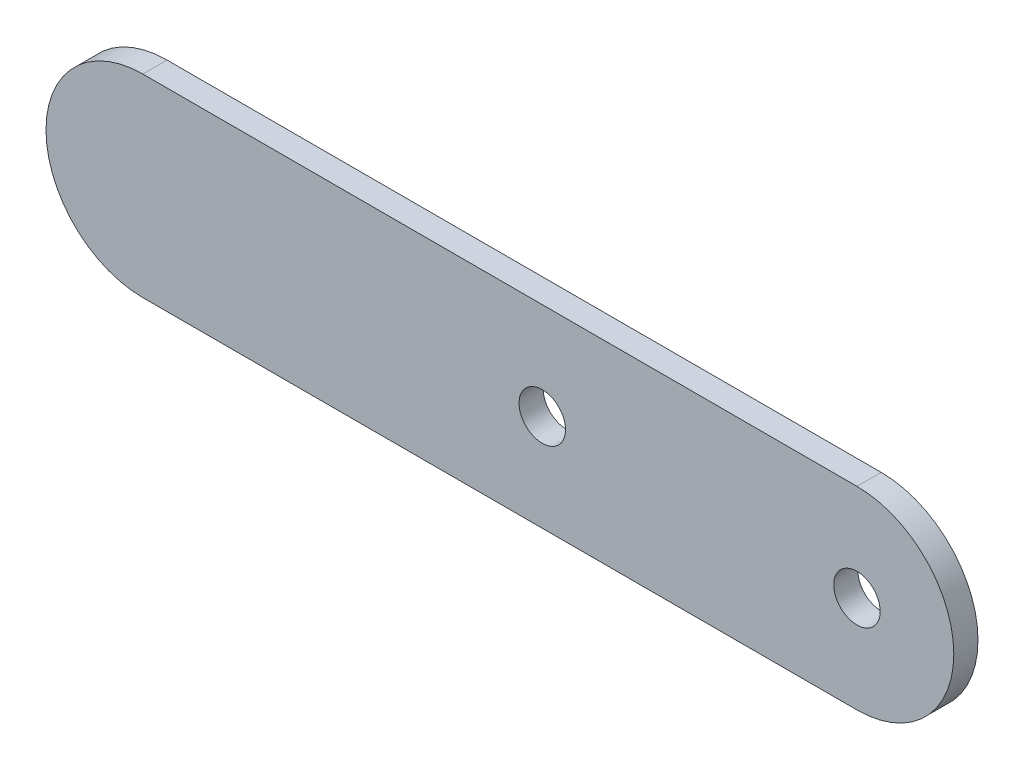
ISO-10303-21;
HEADER;
FILE_DESCRIPTION(('STEP AP214'),'2;1');
FILE_NAME('part.step','',(''),(''),'','','');
FILE_SCHEMA(('AUTOMOTIVE_DESIGN { 1 0 10303 214 1 1 1 1 }'));
ENDSEC;
DATA;
#1=APPLICATION_CONTEXT('core data for automotive mechanical design processes');
#2=APPLICATION_PROTOCOL_DEFINITION('international standard','automotive_design',2000,#1);
#3=PRODUCT_CONTEXT('',#1,'mechanical');
#4=PRODUCT('Part','Part','',(#3));
#5=PRODUCT_RELATED_PRODUCT_CATEGORY('part','',(#4));
#6=PRODUCT_DEFINITION_FORMATION('','',#4);
#7=PRODUCT_DEFINITION_CONTEXT('part definition',#1,'design');
#8=PRODUCT_DEFINITION('design','',#6,#7);
#9=PRODUCT_DEFINITION_SHAPE('','',#8);
#10=(LENGTH_UNIT() NAMED_UNIT(*) SI_UNIT(.MILLI.,.METRE.));
#11=(NAMED_UNIT(*) PLANE_ANGLE_UNIT() SI_UNIT($,.RADIAN.));
#12=(NAMED_UNIT(*) SI_UNIT($,.STERADIAN.) SOLID_ANGLE_UNIT());
#13=UNCERTAINTY_MEASURE_WITH_UNIT(LENGTH_MEASURE(1.E-05),#10,'distance_accuracy_value','');
#14=(GEOMETRIC_REPRESENTATION_CONTEXT(3) GLOBAL_UNCERTAINTY_ASSIGNED_CONTEXT((#13)) GLOBAL_UNIT_ASSIGNED_CONTEXT((#10,
#11,#12)) REPRESENTATION_CONTEXT('',''));
#15=CARTESIAN_POINT('',(0.,0.,0.));
#16=DIRECTION('',(0.,0.,1.));
#17=DIRECTION('',(1.,0.,0.));
#18=AXIS2_PLACEMENT_3D('',#15,#16,#17);
#19=CARTESIAN_POINT('',(46.83125,0.,3.175));
#20=DIRECTION('',(0.,0.,1.));
#21=DIRECTION('',(1.,0.,0.));
#22=AXIS2_PLACEMENT_3D('',#19,#20,#21);
#23=PLANE('',#22);
#24=CARTESIAN_POINT('',(46.83125,0.,3.175));
#25=DIRECTION('',(0.,0.,1.));
#26=DIRECTION('',(1.,0.,0.));
#27=AXIS2_PLACEMENT_3D('',#24,#25,#26);
#28=CIRCLE('',#27,3.048);
#29=CARTESIAN_POINT('',(49.87925,0.,3.175));
#30=VERTEX_POINT('',#29);
#31=EDGE_CURVE('E112',#30,#30,#28,.T.);
#32=ORIENTED_EDGE('',*,*,#31,.F.);
#33=EDGE_LOOP('',(#32));
#34=FACE_BOUND('',#33,.T.);
#35=CARTESIAN_POINT('',(46.83125,0.,3.175));
#36=DIRECTION('',(0.,0.,1.));
#37=DIRECTION('',(1.,0.,0.));
#38=AXIS2_PLACEMENT_3D('',#35,#36,#37);
#39=CIRCLE('',#38,12.7);
#40=CARTESIAN_POINT('',(46.83125,-12.7,3.175));
#41=VERTEX_POINT('',#40);
#42=CARTESIAN_POINT('',(46.83125,12.7,3.175));
#43=VERTEX_POINT('',#42);
#44=EDGE_CURVE('E92',#41,#43,#39,.T.);
#45=ORIENTED_EDGE('',*,*,#44,.T.);
#46=DIRECTION('',(-1.,0.,0.));
#47=VECTOR('',#46,1.);
#48=CARTESIAN_POINT('',(-46.83125,12.7,3.175));
#49=LINE('',#48,#47);
#50=CARTESIAN_POINT('',(-46.83125,12.7,3.175));
#51=VERTEX_POINT('',#50);
#52=EDGE_CURVE('E87',#43,#51,#49,.T.);
#53=ORIENTED_EDGE('',*,*,#52,.T.);
#54=CARTESIAN_POINT('',(-46.83125,0.,3.175));
#55=DIRECTION('',(0.,0.,1.));
#56=DIRECTION('',(1.,0.,0.));
#57=AXIS2_PLACEMENT_3D('',#54,#55,#56);
#58=CIRCLE('',#57,12.7);
#59=CARTESIAN_POINT('',(-46.83125,-12.7,3.175));
#60=VERTEX_POINT('',#59);
#61=EDGE_CURVE('E90',#51,#60,#58,.T.);
#62=ORIENTED_EDGE('',*,*,#61,.T.);
#63=DIRECTION('',(1.,0.,0.));
#64=VECTOR('',#63,1.);
#65=CARTESIAN_POINT('',(-46.83125,-12.7,3.175));
#66=LINE('',#65,#64);
#67=EDGE_CURVE('E57',#60,#41,#66,.T.);
#68=ORIENTED_EDGE('',*,*,#67,.T.);
#69=EDGE_LOOP('',(#45,#53,#62,#68));
#70=FACE_BOUND('',#69,.T.);
#71=CARTESIAN_POINT('',(5.55625000000003,0.,3.175));
#72=DIRECTION('',(0.,0.,1.));
#73=DIRECTION('',(1.,0.,0.));
#74=AXIS2_PLACEMENT_3D('',#71,#72,#73);
#75=CIRCLE('',#74,3.048);
#76=CARTESIAN_POINT('',(8.60425000000003,0.,3.175));
#77=VERTEX_POINT('',#76);
#78=EDGE_CURVE('E134',#77,#77,#75,.T.);
#79=ORIENTED_EDGE('',*,*,#78,.F.);
#80=EDGE_LOOP('',(#79));
#81=FACE_BOUND('',#80,.T.);
#82=ADVANCED_FACE('F39',(#34,#70,#81),#23,.T.);
#83=CARTESIAN_POINT('',(46.83125,0.,0.));
#84=DIRECTION('',(0.,0.,1.));
#85=DIRECTION('',(1.,0.,0.));
#86=AXIS2_PLACEMENT_3D('',#83,#84,#85);
#87=PLANE('',#86);
#88=CARTESIAN_POINT('',(46.83125,0.,0.));
#89=DIRECTION('',(0.,0.,1.));
#90=DIRECTION('',(1.,0.,0.));
#91=AXIS2_PLACEMENT_3D('',#88,#89,#90);
#92=CIRCLE('',#91,12.7);
#93=CARTESIAN_POINT('',(46.83125,-12.7,0.));
#94=VERTEX_POINT('',#93);
#95=CARTESIAN_POINT('',(46.83125,12.7,0.));
#96=VERTEX_POINT('',#95);
#97=EDGE_CURVE('E108',#94,#96,#92,.T.);
#98=ORIENTED_EDGE('',*,*,#97,.F.);
#99=DIRECTION('',(1.,0.,0.));
#100=VECTOR('',#99,1.);
#101=CARTESIAN_POINT('',(-46.83125,-12.7,0.));
#102=LINE('',#101,#100);
#103=CARTESIAN_POINT('',(-46.83125,-12.7,0.));
#104=VERTEX_POINT('',#103);
#105=EDGE_CURVE('E80',#104,#94,#102,.T.);
#106=ORIENTED_EDGE('',*,*,#105,.F.);
#107=CARTESIAN_POINT('',(-46.83125,0.,0.));
#108=DIRECTION('',(0.,0.,1.));
#109=DIRECTION('',(1.,0.,0.));
#110=AXIS2_PLACEMENT_3D('',#107,#108,#109);
#111=CIRCLE('',#110,12.7);
#112=CARTESIAN_POINT('',(-46.83125,12.7,0.));
#113=VERTEX_POINT('',#112);
#114=EDGE_CURVE('E74',#113,#104,#111,.T.);
#115=ORIENTED_EDGE('',*,*,#114,.F.);
#116=DIRECTION('',(-1.,0.,0.));
#117=VECTOR('',#116,1.);
#118=CARTESIAN_POINT('',(-46.83125,12.7,0.));
#119=LINE('',#118,#117);
#120=EDGE_CURVE('E97',#96,#113,#119,.T.);
#121=ORIENTED_EDGE('',*,*,#120,.F.);
#122=EDGE_LOOP('',(#98,#106,#115,#121));
#123=FACE_BOUND('',#122,.T.);
#124=CARTESIAN_POINT('',(46.83125,0.,0.));
#125=DIRECTION('',(0.,0.,1.));
#126=DIRECTION('',(1.,0.,0.));
#127=AXIS2_PLACEMENT_3D('',#124,#125,#126);
#128=CIRCLE('',#127,3.048);
#129=CARTESIAN_POINT('',(49.87925,0.,0.));
#130=VERTEX_POINT('',#129);
#131=EDGE_CURVE('E130',#130,#130,#128,.T.);
#132=ORIENTED_EDGE('',*,*,#131,.T.);
#133=EDGE_LOOP('',(#132));
#134=FACE_BOUND('',#133,.T.);
#135=CARTESIAN_POINT('',(5.55625000000003,0.,0.));
#136=DIRECTION('',(0.,0.,1.));
#137=DIRECTION('',(1.,0.,0.));
#138=AXIS2_PLACEMENT_3D('',#135,#136,#137);
#139=CIRCLE('',#138,3.048);
#140=CARTESIAN_POINT('',(8.60425000000003,0.,0.));
#141=VERTEX_POINT('',#140);
#142=EDGE_CURVE('E138',#141,#141,#139,.T.);
#143=ORIENTED_EDGE('',*,*,#142,.T.);
#144=EDGE_LOOP('',(#143));
#145=FACE_BOUND('',#144,.T.);
#146=ADVANCED_FACE('F125',(#123,#134,#145),#87,.F.);
#147=CARTESIAN_POINT('',(46.83125,0.,3.175));
#148=DIRECTION('',(0.,0.,-1.));
#149=DIRECTION('',(-1.,0.,0.));
#150=AXIS2_PLACEMENT_3D('',#147,#148,#149);
#151=CYLINDRICAL_SURFACE('',#150,12.7);
#152=ORIENTED_EDGE('',*,*,#97,.T.);
#153=DIRECTION('',(0.,0.,-1.));
#154=VECTOR('',#153,1.);
#155=CARTESIAN_POINT('',(46.83125,12.7,3.175));
#156=LINE('',#155,#154);
#157=EDGE_CURVE('E11',#43,#96,#156,.T.);
#158=ORIENTED_EDGE('',*,*,#157,.F.);
#159=ORIENTED_EDGE('',*,*,#44,.F.);
#160=DIRECTION('',(0.,0.,-1.));
#161=VECTOR('',#160,1.);
#162=CARTESIAN_POINT('',(46.83125,-12.7,3.175));
#163=LINE('',#162,#161);
#164=EDGE_CURVE('E104',#41,#94,#163,.T.);
#165=ORIENTED_EDGE('',*,*,#164,.T.);
#166=EDGE_LOOP('',(#152,#158,#159,#165));
#167=FACE_BOUND('',#166,.T.);
#168=ADVANCED_FACE('F41',(#167),#151,.T.);
#169=CARTESIAN_POINT('',(-46.83125,12.7,3.175));
#170=DIRECTION('',(0.,-1.,0.));
#171=DIRECTION('',(1.,0.,0.));
#172=AXIS2_PLACEMENT_3D('',#169,#170,#171);
#173=PLANE('',#172);
#174=ORIENTED_EDGE('',*,*,#120,.T.);
#175=DIRECTION('',(0.,0.,-1.));
#176=VECTOR('',#175,1.);
#177=CARTESIAN_POINT('',(-46.83125,12.7,3.175));
#178=LINE('',#177,#176);
#179=EDGE_CURVE('E49',#51,#113,#178,.T.);
#180=ORIENTED_EDGE('',*,*,#179,.F.);
#181=ORIENTED_EDGE('',*,*,#52,.F.);
#182=ORIENTED_EDGE('',*,*,#157,.T.);
#183=EDGE_LOOP('',(#174,#180,#181,#182));
#184=FACE_BOUND('',#183,.T.);
#185=ADVANCED_FACE('F96',(#184),#173,.F.);
#186=CARTESIAN_POINT('',(-46.83125,0.,3.175));
#187=DIRECTION('',(0.,0.,-1.));
#188=DIRECTION('',(-1.,0.,0.));
#189=AXIS2_PLACEMENT_3D('',#186,#187,#188);
#190=CYLINDRICAL_SURFACE('',#189,12.7);
#191=ORIENTED_EDGE('',*,*,#114,.T.);
#192=DIRECTION('',(0.,0.,-1.));
#193=VECTOR('',#192,1.);
#194=CARTESIAN_POINT('',(-46.83125,-12.7,3.175));
#195=LINE('',#194,#193);
#196=EDGE_CURVE('E99',#60,#104,#195,.T.);
#197=ORIENTED_EDGE('',*,*,#196,.F.);
#198=ORIENTED_EDGE('',*,*,#61,.F.);
#199=ORIENTED_EDGE('',*,*,#179,.T.);
#200=EDGE_LOOP('',(#191,#197,#198,#199));
#201=FACE_BOUND('',#200,.T.);
#202=ADVANCED_FACE('F100',(#201),#190,.T.);
#203=CARTESIAN_POINT('',(-46.83125,-12.7,3.175));
#204=DIRECTION('',(0.,1.,0.));
#205=DIRECTION('',(0.,0.,1.));
#206=AXIS2_PLACEMENT_3D('',#203,#204,#205);
#207=PLANE('',#206);
#208=ORIENTED_EDGE('',*,*,#105,.T.);
#209=ORIENTED_EDGE('',*,*,#164,.F.);
#210=ORIENTED_EDGE('',*,*,#67,.F.);
#211=ORIENTED_EDGE('',*,*,#196,.T.);
#212=EDGE_LOOP('',(#208,#209,#210,#211));
#213=FACE_BOUND('',#212,.T.);
#214=ADVANCED_FACE('F122',(#213),#207,.F.);
#215=CARTESIAN_POINT('',(46.83125,0.,3.175));
#216=DIRECTION('',(0.,0.,-1.));
#217=DIRECTION('',(-1.,0.,0.));
#218=AXIS2_PLACEMENT_3D('',#215,#216,#217);
#219=CYLINDRICAL_SURFACE('',#218,3.048);
#220=ORIENTED_EDGE('',*,*,#31,.T.);
#221=EDGE_LOOP('',(#220));
#222=FACE_BOUND('',#221,.T.);
#223=ORIENTED_EDGE('',*,*,#131,.F.);
#224=EDGE_LOOP('',(#223));
#225=FACE_BOUND('',#224,.T.);
#226=ADVANCED_FACE('F157',(#222,#225),#219,.F.);
#227=CARTESIAN_POINT('',(5.55625000000003,0.,3.175));
#228=DIRECTION('',(0.,0.,-1.));
#229=DIRECTION('',(-1.,0.,0.));
#230=AXIS2_PLACEMENT_3D('',#227,#228,#229);
#231=CYLINDRICAL_SURFACE('',#230,3.048);
#232=ORIENTED_EDGE('',*,*,#78,.T.);
#233=EDGE_LOOP('',(#232));
#234=FACE_BOUND('',#233,.T.);
#235=ORIENTED_EDGE('',*,*,#142,.F.);
#236=EDGE_LOOP('',(#235));
#237=FACE_BOUND('',#236,.T.);
#238=ADVANCED_FACE('F146',(#234,#237),#231,.F.);
#239=CLOSED_SHELL('',(#82,#146,#168,#185,#202,#214,#226,#238));
#240=MANIFOLD_SOLID_BREP('B2',#239);
#241=ADVANCED_BREP_SHAPE_REPRESENTATION('',(#18,#240),#14);
#242=SHAPE_DEFINITION_REPRESENTATION(#9,#241);
ENDSEC;
END-ISO-10303-21;
